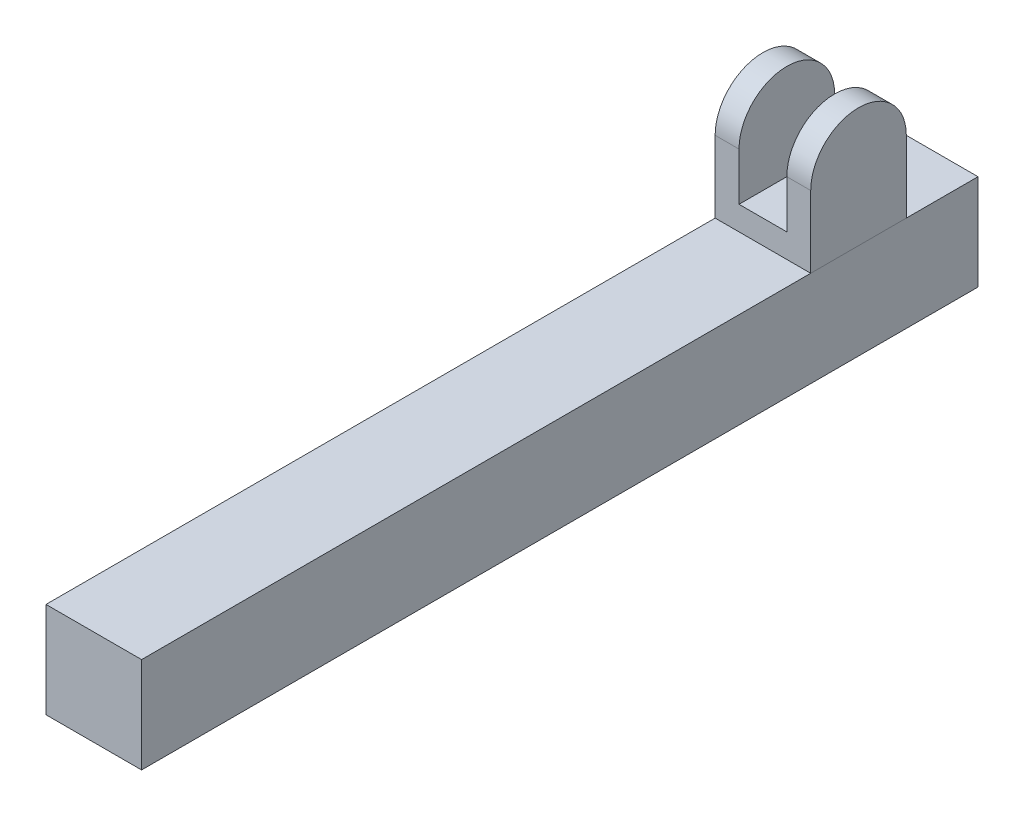
ISO-10303-21;
HEADER;
FILE_DESCRIPTION(('STEP AP214'),'2;1');
FILE_NAME('part.step','',(''),(''),'','','');
FILE_SCHEMA(('AUTOMOTIVE_DESIGN { 1 0 10303 214 1 1 1 1 }'));
ENDSEC;
DATA;
#1=APPLICATION_CONTEXT('core data for automotive mechanical design processes');
#2=APPLICATION_PROTOCOL_DEFINITION('international standard','automotive_design',2000,#1);
#3=PRODUCT_CONTEXT('',#1,'mechanical');
#4=PRODUCT('Part','Part','',(#3));
#5=PRODUCT_RELATED_PRODUCT_CATEGORY('part','',(#4));
#6=PRODUCT_DEFINITION_FORMATION('','',#4);
#7=PRODUCT_DEFINITION_CONTEXT('part definition',#1,'design');
#8=PRODUCT_DEFINITION('design','',#6,#7);
#9=PRODUCT_DEFINITION_SHAPE('','',#8);
#10=(LENGTH_UNIT() NAMED_UNIT(*) SI_UNIT(.MILLI.,.METRE.));
#11=(NAMED_UNIT(*) PLANE_ANGLE_UNIT() SI_UNIT($,.RADIAN.));
#12=(NAMED_UNIT(*) SI_UNIT($,.STERADIAN.) SOLID_ANGLE_UNIT());
#13=UNCERTAINTY_MEASURE_WITH_UNIT(LENGTH_MEASURE(1.E-05),#10,'distance_accuracy_value','');
#14=(GEOMETRIC_REPRESENTATION_CONTEXT(3) GLOBAL_UNCERTAINTY_ASSIGNED_CONTEXT((#13)) GLOBAL_UNIT_ASSIGNED_CONTEXT((#10,
#11,#12)) REPRESENTATION_CONTEXT('',''));
#15=CARTESIAN_POINT('',(0.,0.,0.));
#16=DIRECTION('',(0.,0.,1.));
#17=DIRECTION('',(1.,0.,0.));
#18=AXIS2_PLACEMENT_3D('',#15,#16,#17);
#19=CARTESIAN_POINT('',(4.,10.,10.));
#20=DIRECTION('',(-1.,0.,0.));
#21=DIRECTION('',(0.,-1.,0.));
#22=AXIS2_PLACEMENT_3D('',#19,#20,#21);
#23=CYLINDRICAL_SURFACE('',#22,4.);
#24=CARTESIAN_POINT('',(2.,10.,10.));
#25=DIRECTION('',(1.,0.,0.));
#26=DIRECTION('',(0.,1.,0.));
#27=AXIS2_PLACEMENT_3D('',#24,#25,#26);
#28=CIRCLE('',#27,4.);
#29=CARTESIAN_POINT('',(2.,10.,14.));
#30=VERTEX_POINT('',#29);
#31=CARTESIAN_POINT('',(2.,10.,6.));
#32=VERTEX_POINT('',#31);
#33=EDGE_CURVE('E130',#30,#32,#28,.F.);
#34=ORIENTED_EDGE('',*,*,#33,.F.);
#35=DIRECTION('',(-1.,0.,0.));
#36=VECTOR('',#35,1.);
#37=CARTESIAN_POINT('',(4.,10.,14.));
#38=LINE('',#37,#36);
#39=CARTESIAN_POINT('',(4.,10.,14.));
#40=VERTEX_POINT('',#39);
#41=EDGE_CURVE('E170',#40,#30,#38,.T.);
#42=ORIENTED_EDGE('',*,*,#41,.F.);
#43=CARTESIAN_POINT('',(4.,10.,10.));
#44=DIRECTION('',(-1.,0.,0.));
#45=DIRECTION('',(0.,-1.,0.));
#46=AXIS2_PLACEMENT_3D('',#43,#44,#45);
#47=CIRCLE('',#46,4.);
#48=CARTESIAN_POINT('',(4.,10.,6.));
#49=VERTEX_POINT('',#48);
#50=EDGE_CURVE('E156',#40,#49,#47,.T.);
#51=ORIENTED_EDGE('',*,*,#50,.T.);
#52=DIRECTION('',(-1.,0.,0.));
#53=VECTOR('',#52,1.);
#54=CARTESIAN_POINT('',(4.,10.,6.));
#55=LINE('',#54,#53);
#56=EDGE_CURVE('E72',#49,#32,#55,.T.);
#57=ORIENTED_EDGE('',*,*,#56,.T.);
#58=EDGE_LOOP('',(#34,#42,#51,#57));
#59=FACE_BOUND('',#58,.T.);
#60=ADVANCED_FACE('F48',(#59),#23,.T.);
#61=CARTESIAN_POINT('',(4.,4.,6.));
#62=DIRECTION('',(0.,0.,-1.));
#63=DIRECTION('',(0.,1.,0.));
#64=AXIS2_PLACEMENT_3D('',#61,#62,#63);
#65=PLANE('',#64);
#66=DIRECTION('',(0.,-1.,0.));
#67=VECTOR('',#66,1.);
#68=CARTESIAN_POINT('',(2.,14.,6.));
#69=LINE('',#68,#67);
#70=CARTESIAN_POINT('',(2.,6.,6.));
#71=VERTEX_POINT('',#70);
#72=EDGE_CURVE('E125',#32,#71,#69,.T.);
#73=ORIENTED_EDGE('',*,*,#72,.F.);
#74=ORIENTED_EDGE('',*,*,#56,.F.);
#75=DIRECTION('',(0.,-1.,0.));
#76=VECTOR('',#75,1.);
#77=CARTESIAN_POINT('',(4.,4.,6.));
#78=LINE('',#77,#76);
#79=CARTESIAN_POINT('',(4.,4.,6.));
#80=VERTEX_POINT('',#79);
#81=EDGE_CURVE('E148',#49,#80,#78,.T.);
#82=ORIENTED_EDGE('',*,*,#81,.T.);
#83=DIRECTION('',(-1.,0.,0.));
#84=VECTOR('',#83,1.);
#85=CARTESIAN_POINT('',(4.,4.,6.));
#86=LINE('',#85,#84);
#87=CARTESIAN_POINT('',(-4.,4.,6.));
#88=VERTEX_POINT('',#87);
#89=EDGE_CURVE('E102',#80,#88,#86,.T.);
#90=ORIENTED_EDGE('',*,*,#89,.T.);
#91=DIRECTION('',(0.,-1.,0.));
#92=VECTOR('',#91,1.);
#93=CARTESIAN_POINT('',(-4.,4.,6.));
#94=LINE('',#93,#92);
#95=CARTESIAN_POINT('',(-4.,10.,6.));
#96=VERTEX_POINT('',#95);
#97=EDGE_CURVE('E147',#96,#88,#94,.T.);
#98=ORIENTED_EDGE('',*,*,#97,.F.);
#99=CARTESIAN_POINT('',(-2.,10.,6.));
#100=VERTEX_POINT('',#99);
#101=EDGE_CURVE('E95',#100,#96,#55,.T.);
#102=ORIENTED_EDGE('',*,*,#101,.F.);
#103=DIRECTION('',(0.,1.,0.));
#104=VECTOR('',#103,1.);
#105=CARTESIAN_POINT('',(-2.,14.,6.));
#106=LINE('',#105,#104);
#107=CARTESIAN_POINT('',(-2.,6.,6.));
#108=VERTEX_POINT('',#107);
#109=EDGE_CURVE('E138',#108,#100,#106,.T.);
#110=ORIENTED_EDGE('',*,*,#109,.F.);
#111=DIRECTION('',(-1.,0.,0.));
#112=VECTOR('',#111,1.);
#113=CARTESIAN_POINT('',(2.,6.,6.));
#114=LINE('',#113,#112);
#115=EDGE_CURVE('E132',#71,#108,#114,.T.);
#116=ORIENTED_EDGE('',*,*,#115,.F.);
#117=EDGE_LOOP('',(#73,#74,#82,#90,#98,#102,#110,#116));
#118=FACE_BOUND('',#117,.T.);
#119=ADVANCED_FACE('F50',(#118),#65,.T.);
#120=CARTESIAN_POINT('',(-2.,10.,10.));
#121=DIRECTION('',(-1.,0.,0.));
#122=DIRECTION('',(0.,-1.,0.));
#123=AXIS2_PLACEMENT_3D('',#120,#121,#122);
#124=CIRCLE('',#123,4.);
#125=CARTESIAN_POINT('',(-2.,10.,14.));
#126=VERTEX_POINT('',#125);
#127=EDGE_CURVE('E143',#100,#126,#124,.F.);
#128=ORIENTED_EDGE('',*,*,#127,.F.);
#129=ORIENTED_EDGE('',*,*,#101,.T.);
#130=CARTESIAN_POINT('',(-4.,10.,10.));
#131=DIRECTION('',(-1.,0.,0.));
#132=DIRECTION('',(0.,-1.,0.));
#133=AXIS2_PLACEMENT_3D('',#130,#131,#132);
#134=CIRCLE('',#133,4.);
#135=CARTESIAN_POINT('',(-4.,10.,14.));
#136=VERTEX_POINT('',#135);
#137=EDGE_CURVE('E151',#136,#96,#134,.T.);
#138=ORIENTED_EDGE('',*,*,#137,.F.);
#139=EDGE_CURVE('E173',#126,#136,#38,.T.);
#140=ORIENTED_EDGE('',*,*,#139,.F.);
#141=EDGE_LOOP('',(#128,#129,#138,#140));
#142=FACE_BOUND('',#141,.T.);
#143=ADVANCED_FACE('F192',(#142),#23,.T.);
#144=CARTESIAN_POINT('',(4.,4.,14.));
#145=DIRECTION('',(0.,0.,1.));
#146=DIRECTION('',(1.,0.,0.));
#147=AXIS2_PLACEMENT_3D('',#144,#145,#146);
#148=PLANE('',#147);
#149=DIRECTION('',(0.,1.,0.));
#150=VECTOR('',#149,1.);
#151=CARTESIAN_POINT('',(2.,4.,14.));
#152=LINE('',#151,#150);
#153=CARTESIAN_POINT('',(2.,6.,14.));
#154=VERTEX_POINT('',#153);
#155=EDGE_CURVE('E12',#154,#30,#152,.T.);
#156=ORIENTED_EDGE('',*,*,#155,.F.);
#157=DIRECTION('',(1.,0.,0.));
#158=VECTOR('',#157,1.);
#159=CARTESIAN_POINT('',(4.,6.,14.));
#160=LINE('',#159,#158);
#161=CARTESIAN_POINT('',(-2.,6.,14.));
#162=VERTEX_POINT('',#161);
#163=EDGE_CURVE('E137',#162,#154,#160,.T.);
#164=ORIENTED_EDGE('',*,*,#163,.F.);
#165=DIRECTION('',(0.,-1.,0.));
#166=VECTOR('',#165,1.);
#167=CARTESIAN_POINT('',(-2.,4.,14.));
#168=LINE('',#167,#166);
#169=EDGE_CURVE('E56',#126,#162,#168,.T.);
#170=ORIENTED_EDGE('',*,*,#169,.F.);
#171=ORIENTED_EDGE('',*,*,#139,.T.);
#172=DIRECTION('',(0.,1.,0.));
#173=VECTOR('',#172,1.);
#174=CARTESIAN_POINT('',(-4.,4.,14.));
#175=LINE('',#174,#173);
#176=CARTESIAN_POINT('',(-4.,4.,14.));
#177=VERTEX_POINT('',#176);
#178=EDGE_CURVE('E164',#177,#136,#175,.T.);
#179=ORIENTED_EDGE('',*,*,#178,.F.);
#180=DIRECTION('',(-1.,0.,0.));
#181=VECTOR('',#180,1.);
#182=CARTESIAN_POINT('',(4.,4.,14.));
#183=LINE('',#182,#181);
#184=CARTESIAN_POINT('',(4.,4.,14.));
#185=VERTEX_POINT('',#184);
#186=EDGE_CURVE('E174',#185,#177,#183,.T.);
#187=ORIENTED_EDGE('',*,*,#186,.F.);
#188=DIRECTION('',(0.,1.,0.));
#189=VECTOR('',#188,1.);
#190=CARTESIAN_POINT('',(4.,4.,14.));
#191=LINE('',#190,#189);
#192=EDGE_CURVE('E153',#185,#40,#191,.T.);
#193=ORIENTED_EDGE('',*,*,#192,.T.);
#194=ORIENTED_EDGE('',*,*,#41,.T.);
#195=EDGE_LOOP('',(#156,#164,#170,#171,#179,#187,#193,#194));
#196=FACE_BOUND('',#195,.T.);
#197=ADVANCED_FACE('F182',(#196),#148,.T.);
#198=CARTESIAN_POINT('',(4.,4.,6.));
#199=DIRECTION('',(0.,-1.,0.));
#200=DIRECTION('',(1.,0.,0.));
#201=AXIS2_PLACEMENT_3D('',#198,#199,#200);
#202=PLANE('',#201);
#203=DIRECTION('',(0.,0.,1.));
#204=VECTOR('',#203,1.);
#205=CARTESIAN_POINT('',(-4.,4.,6.));
#206=LINE('',#205,#204);
#207=EDGE_CURVE('E161',#88,#177,#206,.T.);
#208=ORIENTED_EDGE('',*,*,#207,.F.);
#209=ORIENTED_EDGE('',*,*,#89,.F.);
#210=DIRECTION('',(0.,0.,1.));
#211=VECTOR('',#210,1.);
#212=CARTESIAN_POINT('',(4.,4.,6.));
#213=LINE('',#212,#211);
#214=EDGE_CURVE('E150',#80,#185,#213,.T.);
#215=ORIENTED_EDGE('',*,*,#214,.T.);
#216=ORIENTED_EDGE('',*,*,#186,.T.);
#217=EDGE_LOOP('',(#208,#209,#215,#216));
#218=FACE_BOUND('',#217,.T.);
#219=ADVANCED_FACE('F188',(#218),#202,.T.);
#220=CARTESIAN_POINT('',(4.,10.,10.));
#221=DIRECTION('',(-1.,0.,0.));
#222=DIRECTION('',(0.,-1.,0.));
#223=AXIS2_PLACEMENT_3D('',#220,#221,#222);
#224=PLANE('',#223);
#225=ORIENTED_EDGE('',*,*,#81,.F.);
#226=ORIENTED_EDGE('',*,*,#50,.F.);
#227=ORIENTED_EDGE('',*,*,#192,.F.);
#228=ORIENTED_EDGE('',*,*,#214,.F.);
#229=EDGE_LOOP('',(#225,#226,#227,#228));
#230=FACE_BOUND('',#229,.T.);
#231=ADVANCED_FACE('F187',(#230),#224,.F.);
#232=CARTESIAN_POINT('',(-4.,10.,10.));
#233=DIRECTION('',(-1.,0.,0.));
#234=DIRECTION('',(0.,-1.,0.));
#235=AXIS2_PLACEMENT_3D('',#232,#233,#234);
#236=PLANE('',#235);
#237=ORIENTED_EDGE('',*,*,#97,.T.);
#238=ORIENTED_EDGE('',*,*,#207,.T.);
#239=ORIENTED_EDGE('',*,*,#178,.T.);
#240=ORIENTED_EDGE('',*,*,#137,.T.);
#241=EDGE_LOOP('',(#237,#238,#239,#240));
#242=FACE_BOUND('',#241,.T.);
#243=ADVANCED_FACE('F191',(#242),#236,.T.);
#244=CARTESIAN_POINT('',(2.,14.,18.));
#245=DIRECTION('',(1.,0.,0.));
#246=DIRECTION('',(0.,1.,0.));
#247=AXIS2_PLACEMENT_3D('',#244,#245,#246);
#248=PLANE('',#247);
#249=ORIENTED_EDGE('',*,*,#33,.T.);
#250=ORIENTED_EDGE('',*,*,#72,.T.);
#251=DIRECTION('',(0.,0.,-1.));
#252=VECTOR('',#251,1.);
#253=CARTESIAN_POINT('',(2.,6.,18.));
#254=LINE('',#253,#252);
#255=EDGE_CURVE('E128',#154,#71,#254,.T.);
#256=ORIENTED_EDGE('',*,*,#255,.F.);
#257=ORIENTED_EDGE('',*,*,#155,.T.);
#258=EDGE_LOOP('',(#249,#250,#256,#257));
#259=FACE_BOUND('',#258,.T.);
#260=ADVANCED_FACE('F127',(#259),#248,.F.);
#261=CARTESIAN_POINT('',(-2.,14.,18.));
#262=DIRECTION('',(-1.,0.,0.));
#263=DIRECTION('',(0.,-1.,0.));
#264=AXIS2_PLACEMENT_3D('',#261,#262,#263);
#265=PLANE('',#264);
#266=ORIENTED_EDGE('',*,*,#127,.T.);
#267=ORIENTED_EDGE('',*,*,#169,.T.);
#268=DIRECTION('',(0.,0.,-1.));
#269=VECTOR('',#268,1.);
#270=CARTESIAN_POINT('',(-2.,6.,18.));
#271=LINE('',#270,#269);
#272=EDGE_CURVE('E63',#162,#108,#271,.T.);
#273=ORIENTED_EDGE('',*,*,#272,.T.);
#274=ORIENTED_EDGE('',*,*,#109,.T.);
#275=EDGE_LOOP('',(#266,#267,#273,#274));
#276=FACE_BOUND('',#275,.T.);
#277=ADVANCED_FACE('F179',(#276),#265,.F.);
#278=CARTESIAN_POINT('',(2.,6.,18.));
#279=DIRECTION('',(0.,-1.,0.));
#280=DIRECTION('',(0.,0.,-1.));
#281=AXIS2_PLACEMENT_3D('',#278,#279,#280);
#282=PLANE('',#281);
#283=ORIENTED_EDGE('',*,*,#163,.T.);
#284=ORIENTED_EDGE('',*,*,#255,.T.);
#285=ORIENTED_EDGE('',*,*,#115,.T.);
#286=ORIENTED_EDGE('',*,*,#272,.F.);
#287=EDGE_LOOP('',(#283,#284,#285,#286));
#288=FACE_BOUND('',#287,.T.);
#289=ADVANCED_FACE('F134',(#288),#282,.F.);
#290=CLOSED_SHELL('',(#60,#119,#143,#197,#219,#231,#243,#260,#277,#289));
#291=MANIFOLD_SOLID_BREP('B2',#290);
#292=CARTESIAN_POINT('',(-4.,4.,70.));
#293=DIRECTION('',(1.,0.,0.));
#294=DIRECTION('',(0.,1.,0.));
#295=AXIS2_PLACEMENT_3D('',#292,#293,#294);
#296=PLANE('',#295);
#297=DIRECTION('',(0.,-1.,0.));
#298=VECTOR('',#297,1.);
#299=CARTESIAN_POINT('',(-4.,4.,0.));
#300=LINE('',#299,#298);
#301=CARTESIAN_POINT('',(-4.,4.,0.));
#302=VERTEX_POINT('',#301);
#303=CARTESIAN_POINT('',(-4.,-4.,0.));
#304=VERTEX_POINT('',#303);
#305=EDGE_CURVE('E335',#302,#304,#300,.T.);
#306=ORIENTED_EDGE('',*,*,#305,.T.);
#307=DIRECTION('',(0.,0.,-1.));
#308=VECTOR('',#307,1.);
#309=CARTESIAN_POINT('',(-4.,-4.,70.));
#310=LINE('',#309,#308);
#311=CARTESIAN_POINT('',(-4.,-4.,70.));
#312=VERTEX_POINT('',#311);
#313=EDGE_CURVE('E46',#312,#304,#310,.T.);
#314=ORIENTED_EDGE('',*,*,#313,.F.);
#315=DIRECTION('',(0.,-1.,0.));
#316=VECTOR('',#315,1.);
#317=CARTESIAN_POINT('',(-4.,4.,70.));
#318=LINE('',#317,#316);
#319=CARTESIAN_POINT('',(-4.,4.,70.));
#320=VERTEX_POINT('',#319);
#321=EDGE_CURVE('E323',#320,#312,#318,.T.);
#322=ORIENTED_EDGE('',*,*,#321,.F.);
#323=DIRECTION('',(0.,0.,-1.));
#324=VECTOR('',#323,1.);
#325=CARTESIAN_POINT('',(-4.,4.,70.));
#326=LINE('',#325,#324);
#327=EDGE_CURVE('E331',#320,#302,#326,.T.);
#328=ORIENTED_EDGE('',*,*,#327,.T.);
#329=EDGE_LOOP('',(#306,#314,#322,#328));
#330=FACE_BOUND('',#329,.T.);
#331=ADVANCED_FACE('F272',(#330),#296,.F.);
#332=CARTESIAN_POINT('',(-4.,-4.,70.));
#333=DIRECTION('',(0.,1.,0.));
#334=DIRECTION('',(0.,0.,1.));
#335=AXIS2_PLACEMENT_3D('',#332,#333,#334);
#336=PLANE('',#335);
#337=DIRECTION('',(1.,0.,0.));
#338=VECTOR('',#337,1.);
#339=CARTESIAN_POINT('',(-4.,-4.,0.));
#340=LINE('',#339,#338);
#341=CARTESIAN_POINT('',(4.,-4.,0.));
#342=VERTEX_POINT('',#341);
#343=EDGE_CURVE('E327',#304,#342,#340,.T.);
#344=ORIENTED_EDGE('',*,*,#343,.T.);
#345=DIRECTION('',(0.,0.,-1.));
#346=VECTOR('',#345,1.);
#347=CARTESIAN_POINT('',(4.,-4.,70.));
#348=LINE('',#347,#346);
#349=CARTESIAN_POINT('',(4.,-4.,70.));
#350=VERTEX_POINT('',#349);
#351=EDGE_CURVE('E280',#350,#342,#348,.T.);
#352=ORIENTED_EDGE('',*,*,#351,.F.);
#353=DIRECTION('',(1.,0.,0.));
#354=VECTOR('',#353,1.);
#355=CARTESIAN_POINT('',(-4.,-4.,70.));
#356=LINE('',#355,#354);
#357=EDGE_CURVE('E318',#312,#350,#356,.T.);
#358=ORIENTED_EDGE('',*,*,#357,.F.);
#359=ORIENTED_EDGE('',*,*,#313,.T.);
#360=EDGE_LOOP('',(#344,#352,#358,#359));
#361=FACE_BOUND('',#360,.T.);
#362=ADVANCED_FACE('F326',(#361),#336,.F.);
#363=CARTESIAN_POINT('',(4.,4.,70.));
#364=DIRECTION('',(-1.,0.,0.));
#365=DIRECTION('',(0.,0.,1.));
#366=AXIS2_PLACEMENT_3D('',#363,#364,#365);
#367=PLANE('',#366);
#368=DIRECTION('',(0.,1.,0.));
#369=VECTOR('',#368,1.);
#370=CARTESIAN_POINT('',(4.,4.,0.));
#371=LINE('',#370,#369);
#372=CARTESIAN_POINT('',(4.,4.,0.));
#373=VERTEX_POINT('',#372);
#374=EDGE_CURVE('E305',#342,#373,#371,.T.);
#375=ORIENTED_EDGE('',*,*,#374,.T.);
#376=DIRECTION('',(0.,0.,-1.));
#377=VECTOR('',#376,1.);
#378=CARTESIAN_POINT('',(4.,4.,70.));
#379=LINE('',#378,#377);
#380=CARTESIAN_POINT('',(4.,4.,70.));
#381=VERTEX_POINT('',#380);
#382=EDGE_CURVE('E328',#381,#373,#379,.T.);
#383=ORIENTED_EDGE('',*,*,#382,.F.);
#384=DIRECTION('',(0.,1.,0.));
#385=VECTOR('',#384,1.);
#386=CARTESIAN_POINT('',(4.,4.,70.));
#387=LINE('',#386,#385);
#388=EDGE_CURVE('E321',#350,#381,#387,.T.);
#389=ORIENTED_EDGE('',*,*,#388,.F.);
#390=ORIENTED_EDGE('',*,*,#351,.T.);
#391=EDGE_LOOP('',(#375,#383,#389,#390));
#392=FACE_BOUND('',#391,.T.);
#393=ADVANCED_FACE('F329',(#392),#367,.F.);
#394=CARTESIAN_POINT('',(-4.,4.,70.));
#395=DIRECTION('',(0.,-1.,0.));
#396=DIRECTION('',(0.,0.,-1.));
#397=AXIS2_PLACEMENT_3D('',#394,#395,#396);
#398=PLANE('',#397);
#399=DIRECTION('',(-1.,0.,0.));
#400=VECTOR('',#399,1.);
#401=CARTESIAN_POINT('',(-4.,4.,0.));
#402=LINE('',#401,#400);
#403=EDGE_CURVE('E311',#373,#302,#402,.T.);
#404=ORIENTED_EDGE('',*,*,#403,.T.);
#405=ORIENTED_EDGE('',*,*,#327,.F.);
#406=DIRECTION('',(-1.,0.,0.));
#407=VECTOR('',#406,1.);
#408=CARTESIAN_POINT('',(-4.,4.,70.));
#409=LINE('',#408,#407);
#410=EDGE_CURVE('E288',#381,#320,#409,.T.);
#411=ORIENTED_EDGE('',*,*,#410,.F.);
#412=ORIENTED_EDGE('',*,*,#382,.T.);
#413=EDGE_LOOP('',(#404,#405,#411,#412));
#414=FACE_BOUND('',#413,.T.);
#415=ADVANCED_FACE('F343',(#414),#398,.F.);
#416=CARTESIAN_POINT('',(0.,0.,70.));
#417=DIRECTION('',(0.,0.,1.));
#418=DIRECTION('',(1.,0.,0.));
#419=AXIS2_PLACEMENT_3D('',#416,#417,#418);
#420=PLANE('',#419);
#421=ORIENTED_EDGE('',*,*,#321,.T.);
#422=ORIENTED_EDGE('',*,*,#357,.T.);
#423=ORIENTED_EDGE('',*,*,#388,.T.);
#424=ORIENTED_EDGE('',*,*,#410,.T.);
#425=EDGE_LOOP('',(#421,#422,#423,#424));
#426=FACE_BOUND('',#425,.T.);
#427=ADVANCED_FACE('F319',(#426),#420,.T.);
#428=CARTESIAN_POINT('',(0.,0.,0.));
#429=DIRECTION('',(0.,0.,1.));
#430=DIRECTION('',(1.,0.,0.));
#431=AXIS2_PLACEMENT_3D('',#428,#429,#430);
#432=PLANE('',#431);
#433=CARTESIAN_POINT('',(0.,0.,0.));
#434=DIRECTION('',(0.,0.,-1.));
#435=DIRECTION('',(-1.,0.,0.));
#436=AXIS2_PLACEMENT_3D('',#433,#434,#435);
#437=CIRCLE('',#436,3.);
#438=CARTESIAN_POINT('',(-3.,0.,0.));
#439=VERTEX_POINT('',#438);
#440=EDGE_CURVE('E349',#439,#439,#437,.T.);
#441=ORIENTED_EDGE('',*,*,#440,.F.);
#442=EDGE_LOOP('',(#441));
#443=FACE_BOUND('',#442,.T.);
#444=ORIENTED_EDGE('',*,*,#305,.F.);
#445=ORIENTED_EDGE('',*,*,#403,.F.);
#446=ORIENTED_EDGE('',*,*,#374,.F.);
#447=ORIENTED_EDGE('',*,*,#343,.F.);
#448=EDGE_LOOP('',(#444,#445,#446,#447));
#449=FACE_BOUND('',#448,.T.);
#450=ADVANCED_FACE('F346',(#443,#449),#432,.F.);
#451=CARTESIAN_POINT('',(0.,0.,65.));
#452=DIRECTION('',(0.,0.,-1.));
#453=DIRECTION('',(-1.,0.,0.));
#454=AXIS2_PLACEMENT_3D('',#451,#452,#453);
#455=CYLINDRICAL_SURFACE('',#454,3.);
#456=CARTESIAN_POINT('',(0.,0.,65.));
#457=DIRECTION('',(0.,0.,-1.));
#458=DIRECTION('',(-1.,0.,0.));
#459=AXIS2_PLACEMENT_3D('',#456,#457,#458);
#460=CIRCLE('',#459,3.);
#461=CARTESIAN_POINT('',(-3.,0.,65.));
#462=VERTEX_POINT('',#461);
#463=EDGE_CURVE('E338',#462,#462,#460,.T.);
#464=ORIENTED_EDGE('',*,*,#463,.F.);
#465=EDGE_LOOP('',(#464));
#466=FACE_BOUND('',#465,.T.);
#467=ORIENTED_EDGE('',*,*,#440,.T.);
#468=EDGE_LOOP('',(#467));
#469=FACE_BOUND('',#468,.T.);
#470=ADVANCED_FACE('F357',(#466,#469),#455,.F.);
#471=CARTESIAN_POINT('',(0.,0.,65.));
#472=DIRECTION('',(0.,0.,-1.));
#473=DIRECTION('',(-1.,0.,0.));
#474=AXIS2_PLACEMENT_3D('',#471,#472,#473);
#475=PLANE('',#474);
#476=ORIENTED_EDGE('',*,*,#463,.T.);
#477=EDGE_LOOP('',(#476));
#478=FACE_BOUND('',#477,.T.);
#479=ADVANCED_FACE('F355',(#478),#475,.T.);
#480=CLOSED_SHELL('',(#331,#362,#393,#415,#427,#450,#470,#479));
#481=MANIFOLD_SOLID_BREP('B6',#480);
#482=ADVANCED_BREP_SHAPE_REPRESENTATION('',(#18,#291,#481),#14);
#483=SHAPE_DEFINITION_REPRESENTATION(#9,#482);
ENDSEC;
END-ISO-10303-21;
